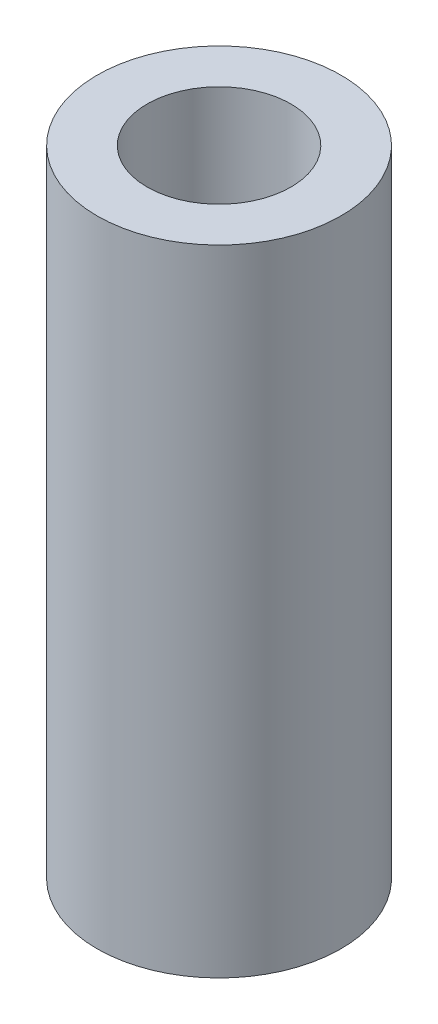
ISO-10303-21;
HEADER;
FILE_DESCRIPTION(('STEP AP214'),'2;1');
FILE_NAME('part.step','',(''),(''),'','','');
FILE_SCHEMA(('AUTOMOTIVE_DESIGN { 1 0 10303 214 1 1 1 1 }'));
ENDSEC;
DATA;
#1=APPLICATION_CONTEXT('core data for automotive mechanical design processes');
#2=APPLICATION_PROTOCOL_DEFINITION('international standard','automotive_design',2000,#1);
#3=PRODUCT_CONTEXT('',#1,'mechanical');
#4=PRODUCT('Part','Part','',(#3));
#5=PRODUCT_RELATED_PRODUCT_CATEGORY('part','',(#4));
#6=PRODUCT_DEFINITION_FORMATION('','',#4);
#7=PRODUCT_DEFINITION_CONTEXT('part definition',#1,'design');
#8=PRODUCT_DEFINITION('design','',#6,#7);
#9=PRODUCT_DEFINITION_SHAPE('','',#8);
#10=(LENGTH_UNIT() NAMED_UNIT(*) SI_UNIT(.MILLI.,.METRE.));
#11=(NAMED_UNIT(*) PLANE_ANGLE_UNIT() SI_UNIT($,.RADIAN.));
#12=(NAMED_UNIT(*) SI_UNIT($,.STERADIAN.) SOLID_ANGLE_UNIT());
#13=UNCERTAINTY_MEASURE_WITH_UNIT(LENGTH_MEASURE(1.E-05),#10,'distance_accuracy_value','');
#14=(GEOMETRIC_REPRESENTATION_CONTEXT(3) GLOBAL_UNCERTAINTY_ASSIGNED_CONTEXT((#13)) GLOBAL_UNIT_ASSIGNED_CONTEXT((#10,
#11,#12)) REPRESENTATION_CONTEXT('',''));
#15=CARTESIAN_POINT('',(0.,0.,0.));
#16=DIRECTION('',(0.,0.,1.));
#17=DIRECTION('',(1.,0.,0.));
#18=AXIS2_PLACEMENT_3D('',#15,#16,#17);
#19=CARTESIAN_POINT('',(0.,31.75,0.));
#20=DIRECTION('',(0.,1.,0.));
#21=DIRECTION('',(0.,0.,1.));
#22=AXIS2_PLACEMENT_3D('',#19,#20,#21);
#23=PLANE('',#22);
#24=CARTESIAN_POINT('',(0.,31.75,0.));
#25=DIRECTION('',(0.,1.,0.));
#26=DIRECTION('',(0.,0.,1.));
#27=AXIS2_PLACEMENT_3D('',#24,#25,#26);
#28=CIRCLE('',#27,6.1);
#29=CARTESIAN_POINT('',(0.,31.75,6.1));
#30=VERTEX_POINT('',#29);
#31=EDGE_CURVE('E10',#30,#30,#28,.T.);
#32=ORIENTED_EDGE('',*,*,#31,.T.);
#33=EDGE_LOOP('',(#32));
#34=FACE_BOUND('',#33,.T.);
#35=CARTESIAN_POINT('',(0.,31.75,0.));
#36=DIRECTION('',(0.,1.,0.));
#37=DIRECTION('',(0.,0.,1.));
#38=AXIS2_PLACEMENT_3D('',#35,#36,#37);
#39=CIRCLE('',#38,3.6);
#40=CARTESIAN_POINT('',(0.,31.75,3.6));
#41=VERTEX_POINT('',#40);
#42=EDGE_CURVE('E48',#41,#41,#39,.T.);
#43=ORIENTED_EDGE('',*,*,#42,.F.);
#44=EDGE_LOOP('',(#43));
#45=FACE_BOUND('',#44,.T.);
#46=ADVANCED_FACE('F37',(#34,#45),#23,.T.);
#47=CARTESIAN_POINT('',(0.,0.,0.));
#48=DIRECTION('',(0.,1.,0.));
#49=DIRECTION('',(0.,0.,1.));
#50=AXIS2_PLACEMENT_3D('',#47,#48,#49);
#51=PLANE('',#50);
#52=CARTESIAN_POINT('',(0.,0.,0.));
#53=DIRECTION('',(0.,1.,0.));
#54=DIRECTION('',(0.,0.,1.));
#55=AXIS2_PLACEMENT_3D('',#52,#53,#54);
#56=CIRCLE('',#55,6.1);
#57=CARTESIAN_POINT('',(0.,0.,6.1));
#58=VERTEX_POINT('',#57);
#59=EDGE_CURVE('E41',#58,#58,#56,.T.);
#60=ORIENTED_EDGE('',*,*,#59,.F.);
#61=EDGE_LOOP('',(#60));
#62=FACE_BOUND('',#61,.T.);
#63=CARTESIAN_POINT('',(0.,0.,0.));
#64=DIRECTION('',(0.,1.,0.));
#65=DIRECTION('',(0.,0.,1.));
#66=AXIS2_PLACEMENT_3D('',#63,#64,#65);
#67=CIRCLE('',#66,3.6);
#68=CARTESIAN_POINT('',(0.,0.,3.6));
#69=VERTEX_POINT('',#68);
#70=EDGE_CURVE('E50',#69,#69,#67,.T.);
#71=ORIENTED_EDGE('',*,*,#70,.T.);
#72=EDGE_LOOP('',(#71));
#73=FACE_BOUND('',#72,.T.);
#74=ADVANCED_FACE('F60',(#62,#73),#51,.F.);
#75=CARTESIAN_POINT('',(0.,31.75,0.));
#76=DIRECTION('',(0.,-1.,0.));
#77=DIRECTION('',(0.,0.,-1.));
#78=AXIS2_PLACEMENT_3D('',#75,#76,#77);
#79=CYLINDRICAL_SURFACE('',#78,6.1);
#80=ORIENTED_EDGE('',*,*,#31,.F.);
#81=EDGE_LOOP('',(#80));
#82=FACE_BOUND('',#81,.T.);
#83=ORIENTED_EDGE('',*,*,#59,.T.);
#84=EDGE_LOOP('',(#83));
#85=FACE_BOUND('',#84,.T.);
#86=ADVANCED_FACE('F39',(#82,#85),#79,.T.);
#87=CARTESIAN_POINT('',(0.,31.75,0.));
#88=DIRECTION('',(0.,-1.,0.));
#89=DIRECTION('',(0.,0.,-1.));
#90=AXIS2_PLACEMENT_3D('',#87,#88,#89);
#91=CYLINDRICAL_SURFACE('',#90,3.6);
#92=ORIENTED_EDGE('',*,*,#42,.T.);
#93=EDGE_LOOP('',(#92));
#94=FACE_BOUND('',#93,.T.);
#95=ORIENTED_EDGE('',*,*,#70,.F.);
#96=EDGE_LOOP('',(#95));
#97=FACE_BOUND('',#96,.T.);
#98=ADVANCED_FACE('F56',(#94,#97),#91,.F.);
#99=CLOSED_SHELL('',(#46,#74,#86,#98));
#100=MANIFOLD_SOLID_BREP('B2',#99);
#101=ADVANCED_BREP_SHAPE_REPRESENTATION('',(#18,#100),#14);
#102=SHAPE_DEFINITION_REPRESENTATION(#9,#101);
ENDSEC;
END-ISO-10303-21;
